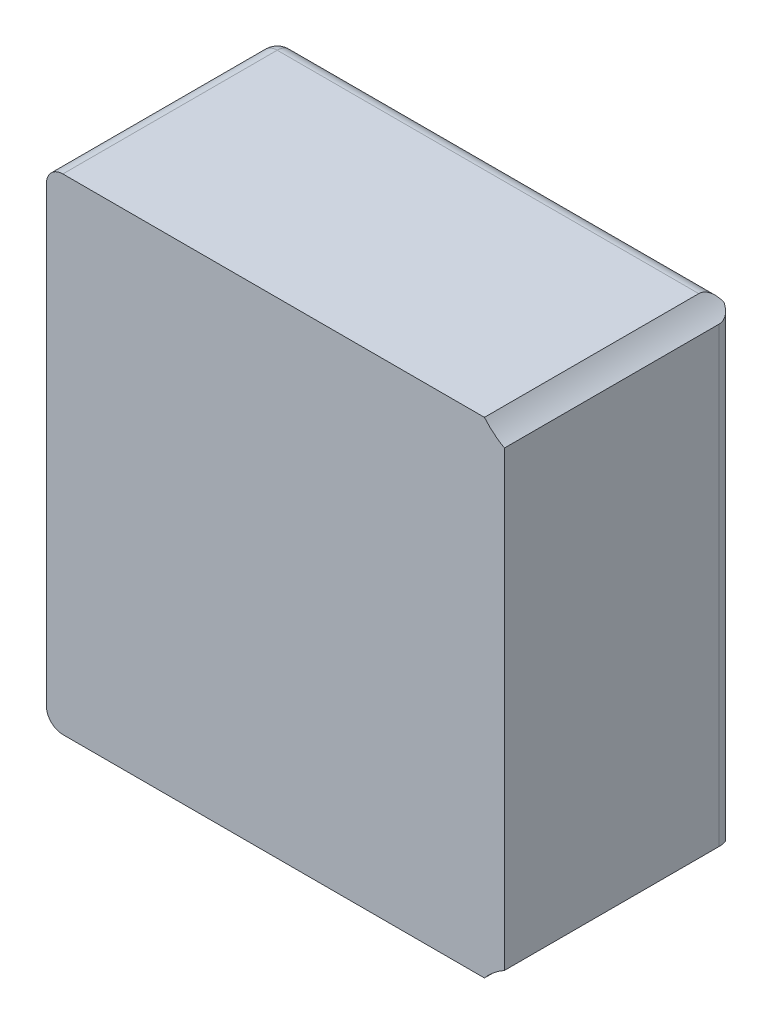
ISO-10303-21;
HEADER;
FILE_DESCRIPTION(('STEP AP214'),'2;1');
FILE_NAME('part.step','',(''),(''),'','','');
FILE_SCHEMA(('AUTOMOTIVE_DESIGN { 1 0 10303 214 1 1 1 1 }'));
ENDSEC;
DATA;
#1=APPLICATION_CONTEXT('core data for automotive mechanical design processes');
#2=APPLICATION_PROTOCOL_DEFINITION('international standard','automotive_design',2000,#1);
#3=PRODUCT_CONTEXT('',#1,'mechanical');
#4=PRODUCT('Part','Part','',(#3));
#5=PRODUCT_RELATED_PRODUCT_CATEGORY('part','',(#4));
#6=PRODUCT_DEFINITION_FORMATION('','',#4);
#7=PRODUCT_DEFINITION_CONTEXT('part definition',#1,'design');
#8=PRODUCT_DEFINITION('design','',#6,#7);
#9=PRODUCT_DEFINITION_SHAPE('','',#8);
#10=(LENGTH_UNIT() NAMED_UNIT(*) SI_UNIT(.MILLI.,.METRE.));
#11=(NAMED_UNIT(*) PLANE_ANGLE_UNIT() SI_UNIT($,.RADIAN.));
#12=(NAMED_UNIT(*) SI_UNIT($,.STERADIAN.) SOLID_ANGLE_UNIT());
#13=UNCERTAINTY_MEASURE_WITH_UNIT(LENGTH_MEASURE(1.E-05),#10,'distance_accuracy_value','');
#14=(GEOMETRIC_REPRESENTATION_CONTEXT(3) GLOBAL_UNCERTAINTY_ASSIGNED_CONTEXT((#13)) GLOBAL_UNIT_ASSIGNED_CONTEXT((#10,
#11,#12)) REPRESENTATION_CONTEXT('',''));
#15=CARTESIAN_POINT('',(0.,0.,0.));
#16=DIRECTION('',(0.,0.,1.));
#17=DIRECTION('',(1.,0.,0.));
#18=AXIS2_PLACEMENT_3D('',#15,#16,#17);
#19=CARTESIAN_POINT('',(97.6105150807782,5.45364491214892,14.));
#20=CARTESIAN_POINT('',(97.957362423811,5.8583970765837,14.));
#21=CARTESIAN_POINT('',(98.3549059432012,6.20182320464996,14.));
#22=CARTESIAN_POINT('',(98.8249350412077,6.45756514132669,14.));
#23=B_SPLINE_CURVE_WITH_KNOTS('',3,(#19,#20,#21,#22),.UNSPECIFIED.,.F.,.F.,(4,4),(0.,1.),.UNSPECIFIED.);
#24=DIRECTION('',(0.,0.,-1.));
#25=VECTOR('',#24,1.);
#26=SURFACE_OF_LINEAR_EXTRUSION('',#23,#25);
#27=CARTESIAN_POINT('',(97.6105150807782,5.45364491214892,0.999999999999999));
#28=CARTESIAN_POINT('',(97.6105144281904,5.45364264963781,0.977081667937636));
#29=CARTESIAN_POINT('',(97.6111907233959,5.45443349795067,0.954175994673404));
#30=CARTESIAN_POINT('',(97.6138829802531,5.45757219398128,0.908560639533463));
#31=CARTESIAN_POINT('',(97.6158983578191,5.45991936285682,0.885850876577851));
#32=CARTESIAN_POINT('',(97.6238979898821,5.46921230686336,0.818533130249394));
#33=CARTESIAN_POINT('',(97.6318362071198,5.47841036560532,0.774435808858496));
#34=CARTESIAN_POINT('',(97.6525869332329,5.50218789967727,0.689038678175605));
#35=CARTESIAN_POINT('',(97.6653933040529,5.51676059765866,0.647735422894864));
#36=CARTESIAN_POINT('',(97.6954160430827,5.55041530067877,0.568695344282839));
#37=CARTESIAN_POINT('',(97.7126372333369,5.56950223457214,0.53096248277215));
#38=CARTESIAN_POINT('',(97.7520310243592,5.61236444728382,0.457642171777818));
#39=CARTESIAN_POINT('',(97.7744284464111,5.63634372180464,0.422296478109556));
#40=CARTESIAN_POINT('',(97.8229085808281,5.68707294808105,0.356496810115855));
#41=CARTESIAN_POINT('',(97.848992684897,5.71382394512519,0.326044692410154));
#42=CARTESIAN_POINT('',(97.9192079923659,5.78398294785302,0.254868812460554));
#43=CARTESIAN_POINT('',(97.9654914848241,5.82860084129502,0.217449155673629));
#44=CARTESIAN_POINT('',(98.0637979702282,5.91905584336986,0.153056737896157));
#45=CARTESIAN_POINT('',(98.1158349014598,5.96489569924367,0.126110094100773));
#46=CARTESIAN_POINT('',(98.2499133642602,6.07704747223135,0.0706293906952575));
#47=CARTESIAN_POINT('',(98.3345403586939,6.14282925200774,0.047329005796763));
#48=CARTESIAN_POINT('',(98.5105283647235,6.26838423162114,0.0151704701939611));
#49=CARTESIAN_POINT('',(98.6018952014117,6.32815212579961,0.00632496904980766));
#50=CARTESIAN_POINT('',(98.7170004962441,6.39666053761393,0.0015447616033489));
#51=CARTESIAN_POINT('',(98.7384528689119,6.40914987431722,0.000915128636762675));
#52=CARTESIAN_POINT('',(98.7815428489236,6.43368275733302,0.000123824232240904));
#53=CARTESIAN_POINT('',(98.803179797807,6.44572741866739,-3.91091023460866E-05));
#54=CARTESIAN_POINT('',(98.8249350412077,6.45756514132669,7.68412792336721E-06));
#55=B_SPLINE_CURVE_WITH_KNOTS('',3,(#27,#28,#29,#30,#31,#32,#33,#34,#35,#36,#37,#38,#39,#40,#41,
#42,#43,#44,#45,#46,#47,#48,#49,#50,#51,#52,#53,#54),.UNSPECIFIED.,.F.,.F.,(4,2,2,2,2,2,2,2,2,2,
2,2,2,4),(0.,0.068706918165359,0.137383887166159,0.273848194485672,0.41014100721337,
0.54658332346819,0.690736489106991,0.834944217899018,1.05683860911758,1.27928285490003,
1.60653083895461,1.93406504672857,2.0085555758593,2.08284450103505),.UNSPECIFIED.);
#56=CARTESIAN_POINT('',(97.6105150807782,5.45364491214892,0.999999999999999));
#57=VERTEX_POINT('',#56);
#58=CARTESIAN_POINT('',(98.2239707958994,6.05460915745689,0.083064633424274));
#59=VERTEX_POINT('',#58);
#60=EDGE_CURVE('E248',#57,#59,#55,.T.);
#61=ORIENTED_EDGE('',*,*,#60,.T.);
#62=CARTESIAN_POINT('',(97.6105150807782,5.45364491214892,0.023258437164949));
#63=CARTESIAN_POINT('',(97.6456892743886,5.49470076942046,0.0155517994449178));
#64=CARTESIAN_POINT('',(97.6816709183293,5.53544090998647,0.00963125760550994));
#65=CARTESIAN_POINT('',(97.7552087736112,5.61607668451945,0.00174229313742816));
#66=CARTESIAN_POINT('',(97.792769184862,5.65596957707132,-0.000214804316745668));
#67=CARTESIAN_POINT('',(97.8696557197014,5.73490514623757,0.000254180500738657));
#68=CARTESIAN_POINT('',(97.9089970452342,5.77393303430793,0.00273026269684683));
#69=CARTESIAN_POINT('',(97.9886795695857,5.85020363095891,0.0126811343130083));
#70=CARTESIAN_POINT('',(98.029019435829,5.88744854266958,0.0201495746459563));
#71=CARTESIAN_POINT('',(98.1209305599001,5.96922654050553,0.043348409345827));
#72=CARTESIAN_POINT('',(98.1726792201679,6.01311726445957,0.0607290705298571));
#73=CARTESIAN_POINT('',(98.2753642306453,6.09618347031103,0.105444496058237));
#74=CARTESIAN_POINT('',(98.3263031238687,6.13537849806546,0.132735945689449));
#75=CARTESIAN_POINT('',(98.4177333639513,6.2025894307852,0.193083091088562));
#76=CARTESIAN_POINT('',(98.4586335879334,6.23139866425919,0.224625801259152));
#77=CARTESIAN_POINT('',(98.5366022547194,6.28436651513706,0.295512391131562));
#78=CARTESIAN_POINT('',(98.5736697945178,6.30852403771823,0.334858102928782));
#79=CARTESIAN_POINT('',(98.6421858484804,6.35179791524872,0.42108028587434));
#80=CARTESIAN_POINT('',(98.6736000520153,6.37088380242484,0.467999664891708));
#81=CARTESIAN_POINT('',(98.7285900503864,6.40349166591151,0.567959594490413));
#82=CARTESIAN_POINT('',(98.7521703643329,6.41701685107958,0.620996592147042));
#83=CARTESIAN_POINT('',(98.7886311244825,6.43761942748115,0.727546820002718));
#84=CARTESIAN_POINT('',(98.8021458262749,6.4450823885012,0.780765968379882));
#85=CARTESIAN_POINT('',(98.8157659568803,6.45256366930849,0.862092763311364));
#86=CARTESIAN_POINT('',(98.8191975213336,6.454438570688,0.889518125120358));
#87=CARTESIAN_POINT('',(98.8237834596355,6.45693881106416,0.944623663833934));
#88=CARTESIAN_POINT('',(98.8249371201796,6.45756375865014,0.972303917830459));
#89=CARTESIAN_POINT('',(98.8249350412078,6.45756514132669,1.00000000000001));
#90=B_SPLINE_CURVE_WITH_KNOTS('',3,(#62,#63,#64,#65,#66,#67,#68,#69,#70,#71,#72,#73,#74,#75,#76,
#77,#78,#79,#80,#81,#82,#83,#84,#85,#86,#87,#88,#89),.UNSPECIFIED.,.F.,.F.,(4,2,2,2,2,2,2,2,2,2,
2,2,2,4),(0.,0.163837701649203,0.328142897514093,0.494312909717666,0.660271994397908,
0.869647464700133,1.07811866872696,1.25480924248848,1.43154135129944,1.60931232881893,
1.78698057738229,1.95219262946424,2.03519278959239,2.11821893633299),.UNSPECIFIED.);
#91=CARTESIAN_POINT('',(98.8249350412076,6.45756514132668,0.999999999999999));
#92=VERTEX_POINT('',#91);
#93=EDGE_CURVE('E148',#59,#92,#90,.T.);
#94=ORIENTED_EDGE('',*,*,#93,.T.);
#95=DIRECTION('',(0.,0.,-1.));
#96=VECTOR('',#95,1.);
#97=CARTESIAN_POINT('',(98.8249350412076,6.45756514132668,14.));
#98=LINE('',#97,#96);
#99=CARTESIAN_POINT('',(98.8249350412076,6.45756514132668,14.));
#100=VERTEX_POINT('',#99);
#101=EDGE_CURVE('E128',#100,#92,#98,.T.);
#102=ORIENTED_EDGE('',*,*,#101,.F.);
#103=CARTESIAN_POINT('',(98.8249350412077,6.45756514132669,14.));
#104=CARTESIAN_POINT('',(98.3549059432012,6.20182320464996,14.));
#105=CARTESIAN_POINT('',(97.957362423811,5.8583970765837,14.));
#106=CARTESIAN_POINT('',(97.6105150807782,5.45364491214892,14.));
#107=B_SPLINE_CURVE_WITH_KNOTS('',3,(#103,#104,#105,#106),.UNSPECIFIED.,.F.,.F.,(4,4),(0.,1.),.UNSPECIFIED.);
#108=CARTESIAN_POINT('',(97.6105150807782,5.45364491214892,14.));
#109=VERTEX_POINT('',#108);
#110=EDGE_CURVE('E134',#109,#100,#107,.F.);
#111=ORIENTED_EDGE('',*,*,#110,.F.);
#112=DIRECTION('',(0.,0.,-1.));
#113=VECTOR('',#112,1.);
#114=CARTESIAN_POINT('',(97.6105150807782,5.45364491214892,14.));
#115=LINE('',#114,#113);
#116=EDGE_CURVE('E303',#109,#57,#115,.T.);
#117=ORIENTED_EDGE('',*,*,#116,.T.);
#118=EDGE_LOOP('',(#61,#94,#102,#111,#117));
#119=FACE_BOUND('',#118,.T.);
#120=ADVANCED_FACE('F36',(#119),#26,.F.);
#121=CARTESIAN_POINT('',(98.8249350412077,33.9009571152319,14.));
#122=DIRECTION('',(-1.,0.,0.));
#123=DIRECTION('',(0.,-1.,0.));
#124=AXIS2_PLACEMENT_3D('',#121,#122,#123);
#125=PLANE('',#124);
#126=ORIENTED_EDGE('',*,*,#101,.T.);
#127=DIRECTION('',(0.,1.,0.));
#128=VECTOR('',#127,1.);
#129=CARTESIAN_POINT('',(98.8249350412077,33.9009571152319,0.999999999999999));
#130=LINE('',#129,#128);
#131=CARTESIAN_POINT('',(98.8249350412077,33.9009571152319,0.999999999999999));
#132=VERTEX_POINT('',#131);
#133=EDGE_CURVE('E149',#92,#132,#130,.T.);
#134=ORIENTED_EDGE('',*,*,#133,.T.);
#135=DIRECTION('',(0.,0.,-1.));
#136=VECTOR('',#135,1.);
#137=CARTESIAN_POINT('',(98.8249350412077,33.9009571152319,14.));
#138=LINE('',#137,#136);
#139=CARTESIAN_POINT('',(98.8249350412077,33.9009571152319,14.));
#140=VERTEX_POINT('',#139);
#141=EDGE_CURVE('E131',#140,#132,#138,.T.);
#142=ORIENTED_EDGE('',*,*,#141,.F.);
#143=DIRECTION('',(0.,1.,0.));
#144=VECTOR('',#143,1.);
#145=CARTESIAN_POINT('',(98.8249350412077,33.9009571152319,14.));
#146=LINE('',#145,#144);
#147=EDGE_CURVE('E123',#100,#140,#146,.T.);
#148=ORIENTED_EDGE('',*,*,#147,.F.);
#149=EDGE_LOOP('',(#126,#134,#142,#148));
#150=FACE_BOUND('',#149,.T.);
#151=ADVANCED_FACE('F125',(#150),#125,.F.);
#152=CARTESIAN_POINT('',(98.8249350412077,33.9009571152319,14.));
#153=CARTESIAN_POINT('',(98.3549059420193,34.1566990525517,14.));
#154=CARTESIAN_POINT('',(97.9573624339175,34.5001252002607,14.));
#155=CARTESIAN_POINT('',(97.6105150906763,34.9048773626016,14.));
#156=B_SPLINE_CURVE_WITH_KNOTS('',3,(#152,#153,#154,#155),.UNSPECIFIED.,.F.,.F.,(4,4),(0.,1.),.UNSPECIFIED.);
#157=DIRECTION('',(0.,0.,-1.));
#158=VECTOR('',#157,1.);
#159=SURFACE_OF_LINEAR_EXTRUSION('',#156,#158);
#160=ORIENTED_EDGE('',*,*,#141,.T.);
#161=CARTESIAN_POINT('',(98.8249350412077,33.9009571152319,0.999999999999999));
#162=CARTESIAN_POINT('',(98.8249362438431,33.9009581762692,0.974751058401219));
#163=CARTESIAN_POINT('',(98.8239780190628,33.9014776480358,0.949514700102299));
#164=CARTESIAN_POINT('',(98.8201645505362,33.9035560584132,0.899233037686511));
#165=CARTESIAN_POINT('',(98.8173096260898,33.9051148220646,0.874187702129614));
#166=CARTESIAN_POINT('',(98.8059591864594,33.911339401252,0.799752110740666));
#167=CARTESIAN_POINT('',(98.794677655642,33.9175535001919,0.750879381318651));
#168=CARTESIAN_POINT('',(98.7652295337208,33.9340907186925,0.6560285097351));
#169=CARTESIAN_POINT('',(98.7470632614002,33.9444136480037,0.610050233667072));
#170=CARTESIAN_POINT('',(98.7047164053236,33.9691001753442,0.522123833441968));
#171=CARTESIAN_POINT('',(98.6805345976536,33.9834645957287,0.480176531833018));
#172=CARTESIAN_POINT('',(98.6265702942513,34.0165069582225,0.400192112484578));
#173=CARTESIAN_POINT('',(98.5966583304111,34.0352875034305,0.362285292521506));
#174=CARTESIAN_POINT('',(98.5329836538755,34.0766710234713,0.292250059018813));
#175=CARTESIAN_POINT('',(98.4992195793893,34.0992753514521,0.260123699384218));
#176=CARTESIAN_POINT('',(98.4256691751153,34.1503460291664,0.19898445625974));
#177=CARTESIAN_POINT('',(98.3856174409995,34.1791709141211,0.170592907612779));
#178=CARTESIAN_POINT('',(98.303939835097,34.2404058587712,0.120884179783364));
#179=CARTESIAN_POINT('',(98.2623132929785,34.2728174567459,0.0995700517851871));
#180=CARTESIAN_POINT('',(98.157705808858,34.3576445240411,0.0545179387674308));
#181=CARTESIAN_POINT('',(98.0944711273182,34.4119487269819,0.0349122232304204));
#182=CARTESIAN_POINT('',(97.9696726808488,34.5255410327844,0.00846379739683166));
#183=CARTESIAN_POINT('',(97.9081150750178,34.5848448945912,0.00166314948409855));
#184=CARTESIAN_POINT('',(97.8067675213699,34.6878401707598,-0.000692265456712929));
#185=CARTESIAN_POINT('',(97.7661350610964,34.7306855415623,0.000924682636549816));
#186=CARTESIAN_POINT('',(97.6868749660855,34.8171950477451,0.00878730443834067));
#187=CARTESIAN_POINT('',(97.6482344968972,34.8608505442227,0.0149978916928505));
#188=CARTESIAN_POINT('',(97.6105150906763,34.9048773626016,0.0232584349920684));
#189=B_SPLINE_CURVE_WITH_KNOTS('',3,(#161,#162,#163,#164,#165,#166,#167,#168,#169,#170,#171,
#172,#173,#174,#175,#176,#177,#178,#179,#180,#181,#182,#183,#184,#185,#186,#187,#188),
.UNSPECIFIED.,.F.,.F.,(4,2,2,2,2,2,2,2,2,2,2,2,2,4),(0.,0.0756985257886365,0.151384311338969,
0.302214469309151,0.453037644267384,0.603891530670632,0.758674466439555,0.913512291321303,
1.08365012028226,1.25386120331903,1.5093188547171,1.76561418528502,1.94261814250265,
2.11828391655872),.UNSPECIFIED.);
#190=CARTESIAN_POINT('',(98.2239707925065,34.3039131139004,0.0830646319476043));
#191=VERTEX_POINT('',#190);
#192=EDGE_CURVE('E168',#132,#191,#189,.T.);
#193=ORIENTED_EDGE('',*,*,#192,.T.);
#194=CARTESIAN_POINT('',(98.8249350412077,33.9009571152319,7.68419924261979E-06));
#195=CARTESIAN_POINT('',(98.7655886820896,33.9332359953319,-9.41459643886954E-05));
#196=CARTESIAN_POINT('',(98.707094802894,33.9671034934114,0.00131534350932905));
#197=CARTESIAN_POINT('',(98.5914624819735,34.0381103556953,0.00825851113033593));
#198=CARTESIAN_POINT('',(98.5343473752789,34.0752828781664,0.0138394487421541));
#199=CARTESIAN_POINT('',(98.3909524347141,34.1739463454297,0.0349168427435199));
#200=CARTESIAN_POINT('',(98.3063986135857,34.2373250369933,0.0542310787866778));
#201=CARTESIAN_POINT('',(98.186178559868,34.334440830268,0.0962808371506677));
#202=CARTESIAN_POINT('',(98.1472803182974,34.3670847598162,0.112430557727617));
#203=CARTESIAN_POINT('',(98.0720099373515,34.4324471033215,0.149656550865163));
#204=CARTESIAN_POINT('',(98.0356355239642,34.4651654220577,0.170728311810153));
#205=CARTESIAN_POINT('',(97.9613524510172,34.5340829961723,0.221437158743859));
#206=CARTESIAN_POINT('',(97.9238584038932,34.5701822543117,0.251831365633254));
#207=CARTESIAN_POINT('',(97.8536394000742,34.6398500919688,0.320155121545799));
#208=CARTESIAN_POINT('',(97.8209106193209,34.6734206901404,0.358078570042944));
#209=CARTESIAN_POINT('',(97.7659032837975,34.7312321495456,0.435122202237449));
#210=CARTESIAN_POINT('',(97.7427916455433,34.7561137790005,0.473160604971699));
#211=CARTESIAN_POINT('',(97.7014983361687,34.8012961572884,0.55436766668392));
#212=CARTESIAN_POINT('',(97.6833170902469,34.8215965110052,0.597536767673544));
#213=CARTESIAN_POINT('',(97.6525129756614,34.8563746930622,0.688483295695676));
#214=CARTESIAN_POINT('',(97.6399364433184,34.8708039002967,0.736295298361718));
#215=CARTESIAN_POINT('',(97.6212191287624,34.8923946346756,0.834685634080232));
#216=CARTESIAN_POINT('',(97.6150604442172,34.8995763765572,0.885255855697638));
#217=CARTESIAN_POINT('',(97.611680601167,34.9035178417552,0.946779532432597));
#218=CARTESIAN_POINT('',(97.6112434138164,34.9040276896368,0.957419894014711));
#219=CARTESIAN_POINT('',(97.6106611730673,34.9047067791611,0.978705327630038));
#220=CARTESIAN_POINT('',(97.6105157325044,34.9048764722084,0.989350374644694));
#221=CARTESIAN_POINT('',(97.6105150906763,34.9048773626016,0.999999999999999));
#222=B_SPLINE_CURVE_WITH_KNOTS('',3,(#194,#195,#196,#197,#198,#199,#200,#201,#202,#203,#204,
#205,#206,#207,#208,#209,#210,#211,#212,#213,#214,#215,#216,#217,#218,#219,#220,#221),
.UNSPECIFIED.,.F.,.F.,(4,2,2,2,2,2,2,2,2,2,2,2,2,4),(0.,0.202615914076961,0.407562787622504,
0.728139394136735,0.887771771465733,1.04725839761419,1.22746493131245,1.40752604521165,
1.55988444942851,1.71225598890856,1.86586487712148,2.01904412301151,2.05102396939923,
2.08296134858136),.UNSPECIFIED.);
#223=CARTESIAN_POINT('',(97.6105150906763,34.9048773626016,0.999999999999999));
#224=VERTEX_POINT('',#223);
#225=EDGE_CURVE('E151',#191,#224,#222,.T.);
#226=ORIENTED_EDGE('',*,*,#225,.T.);
#227=DIRECTION('',(0.,0.,-1.));
#228=VECTOR('',#227,1.);
#229=CARTESIAN_POINT('',(97.6105150906763,34.9048773626016,14.));
#230=LINE('',#229,#228);
#231=CARTESIAN_POINT('',(97.6105150906763,34.9048773626016,14.));
#232=VERTEX_POINT('',#231);
#233=EDGE_CURVE('E153',#232,#224,#230,.T.);
#234=ORIENTED_EDGE('',*,*,#233,.F.);
#235=CARTESIAN_POINT('',(97.6105150906763,34.9048773626016,14.));
#236=CARTESIAN_POINT('',(97.9573624339175,34.5001252002607,14.));
#237=CARTESIAN_POINT('',(98.3549059420193,34.1566990525517,14.));
#238=CARTESIAN_POINT('',(98.8249350412077,33.9009571152319,14.));
#239=B_SPLINE_CURVE_WITH_KNOTS('',3,(#235,#236,#237,#238),.UNSPECIFIED.,.F.,.F.,(4,4),(0.,1.),.UNSPECIFIED.);
#240=EDGE_CURVE('E133',#140,#232,#239,.F.);
#241=ORIENTED_EDGE('',*,*,#240,.F.);
#242=EDGE_LOOP('',(#160,#193,#226,#234,#241));
#243=FACE_BOUND('',#242,.T.);
#244=ADVANCED_FACE('F178',(#243),#159,.F.);
#245=CARTESIAN_POINT('',(71.0404814985495,34.9048773626016,14.));
#246=DIRECTION('',(0.,-1.,0.));
#247=DIRECTION('',(0.,0.,-1.));
#248=AXIS2_PLACEMENT_3D('',#245,#246,#247);
#249=PLANE('',#248);
#250=DIRECTION('',(-1.,0.,0.));
#251=VECTOR('',#250,1.);
#252=CARTESIAN_POINT('',(71.0404814985495,34.9048773626016,0.999999999999999));
#253=LINE('',#252,#251);
#254=CARTESIAN_POINT('',(72.0404814985495,34.9048773626016,0.999999999999999));
#255=VERTEX_POINT('',#254);
#256=EDGE_CURVE('E316',#224,#255,#253,.T.);
#257=ORIENTED_EDGE('',*,*,#256,.T.);
#258=DIRECTION('',(0.,0.,-1.));
#259=VECTOR('',#258,1.);
#260=CARTESIAN_POINT('',(72.0404814985495,34.9048773626016,14.));
#261=LINE('',#260,#259);
#262=CARTESIAN_POINT('',(72.0404814985495,34.9048773626016,14.));
#263=VERTEX_POINT('',#262);
#264=EDGE_CURVE('E61',#255,#263,#261,.F.);
#265=ORIENTED_EDGE('',*,*,#264,.T.);
#266=DIRECTION('',(-1.,0.,0.));
#267=VECTOR('',#266,1.);
#268=CARTESIAN_POINT('',(71.0404814985495,34.9048773626016,14.));
#269=LINE('',#268,#267);
#270=EDGE_CURVE('E204',#232,#263,#269,.T.);
#271=ORIENTED_EDGE('',*,*,#270,.F.);
#272=ORIENTED_EDGE('',*,*,#233,.T.);
#273=EDGE_LOOP('',(#257,#265,#271,#272));
#274=FACE_BOUND('',#273,.T.);
#275=ADVANCED_FACE('F184',(#274),#249,.F.);
#276=CARTESIAN_POINT('',(71.0404814985495,34.9048773626016,14.));
#277=DIRECTION('',(1.,0.,0.));
#278=DIRECTION('',(0.,0.,-1.));
#279=AXIS2_PLACEMENT_3D('',#276,#277,#278);
#280=PLANE('',#279);
#281=DIRECTION('',(0.,-1.,0.));
#282=VECTOR('',#281,1.);
#283=CARTESIAN_POINT('',(71.0404814985495,34.9048773626016,14.));
#284=LINE('',#283,#282);
#285=CARTESIAN_POINT('',(71.0404814985495,33.9048773626016,14.));
#286=VERTEX_POINT('',#285);
#287=CARTESIAN_POINT('',(71.0404814985495,6.45364491214892,14.));
#288=VERTEX_POINT('',#287);
#289=EDGE_CURVE('E199',#286,#288,#284,.T.);
#290=ORIENTED_EDGE('',*,*,#289,.F.);
#291=DIRECTION('',(0.,0.,-1.));
#292=VECTOR('',#291,1.);
#293=CARTESIAN_POINT('',(71.0404814985495,33.9048773626016,14.));
#294=LINE('',#293,#292);
#295=CARTESIAN_POINT('',(71.0404814985495,33.9048773626016,0.999999999999999));
#296=VERTEX_POINT('',#295);
#297=EDGE_CURVE('E305',#286,#296,#294,.T.);
#298=ORIENTED_EDGE('',*,*,#297,.T.);
#299=DIRECTION('',(0.,-1.,0.));
#300=VECTOR('',#299,1.);
#301=CARTESIAN_POINT('',(71.0404814985495,34.9048773626016,0.999999999999999));
#302=LINE('',#301,#300);
#303=CARTESIAN_POINT('',(71.0404814985495,6.45364491214892,0.999999999999999));
#304=VERTEX_POINT('',#303);
#305=EDGE_CURVE('E319',#296,#304,#302,.T.);
#306=ORIENTED_EDGE('',*,*,#305,.T.);
#307=DIRECTION('',(0.,0.,-1.));
#308=VECTOR('',#307,1.);
#309=CARTESIAN_POINT('',(71.0404814985495,6.45364491214892,14.));
#310=LINE('',#309,#308);
#311=EDGE_CURVE('E307',#304,#288,#310,.F.);
#312=ORIENTED_EDGE('',*,*,#311,.T.);
#313=EDGE_LOOP('',(#290,#298,#306,#312));
#314=FACE_BOUND('',#313,.T.);
#315=ADVANCED_FACE('F362',(#314),#280,.F.);
#316=CARTESIAN_POINT('',(97.6105150807782,5.45364491214892,14.));
#317=DIRECTION('',(0.,1.,0.));
#318=DIRECTION('',(0.,0.,1.));
#319=AXIS2_PLACEMENT_3D('',#316,#317,#318);
#320=PLANE('',#319);
#321=DIRECTION('',(1.,0.,0.));
#322=VECTOR('',#321,1.);
#323=CARTESIAN_POINT('',(97.6105150807782,5.45364491214892,14.));
#324=LINE('',#323,#322);
#325=CARTESIAN_POINT('',(72.0404814985495,5.45364491214892,14.));
#326=VERTEX_POINT('',#325);
#327=EDGE_CURVE('E139',#326,#109,#324,.T.);
#328=ORIENTED_EDGE('',*,*,#327,.F.);
#329=DIRECTION('',(0.,0.,-1.));
#330=VECTOR('',#329,1.);
#331=CARTESIAN_POINT('',(72.0404814985495,5.45364491214892,14.));
#332=LINE('',#331,#330);
#333=CARTESIAN_POINT('',(72.0404814985495,5.45364491214892,0.999999999999999));
#334=VERTEX_POINT('',#333);
#335=EDGE_CURVE('E11',#326,#334,#332,.T.);
#336=ORIENTED_EDGE('',*,*,#335,.T.);
#337=DIRECTION('',(1.,0.,0.));
#338=VECTOR('',#337,1.);
#339=CARTESIAN_POINT('',(97.6105150807782,5.45364491214892,0.999999999999999));
#340=LINE('',#339,#338);
#341=EDGE_CURVE('E321',#334,#57,#340,.T.);
#342=ORIENTED_EDGE('',*,*,#341,.T.);
#343=ORIENTED_EDGE('',*,*,#116,.F.);
#344=EDGE_LOOP('',(#328,#336,#342,#343));
#345=FACE_BOUND('',#344,.T.);
#346=ADVANCED_FACE('F220',(#345),#320,.F.);
#347=CARTESIAN_POINT('',(98.1715319028778,6.01148386214707,14.));
#348=DIRECTION('',(0.,0.,1.));
#349=DIRECTION('',(1.,0.,0.));
#350=AXIS2_PLACEMENT_3D('',#347,#348,#349);
#351=PLANE('',#350);
#352=ORIENTED_EDGE('',*,*,#270,.T.);
#353=CARTESIAN_POINT('',(72.0404814985495,33.9048773626016,14.));
#354=DIRECTION('',(0.,0.,1.));
#355=DIRECTION('',(1.,0.,0.));
#356=AXIS2_PLACEMENT_3D('',#353,#354,#355);
#357=CIRCLE('',#356,1.);
#358=EDGE_CURVE('E45',#263,#286,#357,.T.);
#359=ORIENTED_EDGE('',*,*,#358,.T.);
#360=ORIENTED_EDGE('',*,*,#289,.T.);
#361=CARTESIAN_POINT('',(72.0404814985495,6.45364491214892,14.));
#362=DIRECTION('',(0.,0.,1.));
#363=DIRECTION('',(1.,0.,0.));
#364=AXIS2_PLACEMENT_3D('',#361,#362,#363);
#365=CIRCLE('',#364,1.);
#366=EDGE_CURVE('E53',#288,#326,#365,.T.);
#367=ORIENTED_EDGE('',*,*,#366,.T.);
#368=ORIENTED_EDGE('',*,*,#327,.T.);
#369=ORIENTED_EDGE('',*,*,#110,.T.);
#370=ORIENTED_EDGE('',*,*,#147,.T.);
#371=ORIENTED_EDGE('',*,*,#240,.T.);
#372=EDGE_LOOP('',(#352,#359,#360,#367,#368,#369,#370,#371));
#373=FACE_BOUND('',#372,.T.);
#374=ADVANCED_FACE('F138',(#373),#351,.T.);
#375=CARTESIAN_POINT('',(98.1715319028778,6.01148386214707,0.));
#376=DIRECTION('',(0.,0.,1.));
#377=DIRECTION('',(1.,0.,0.));
#378=AXIS2_PLACEMENT_3D('',#375,#376,#377);
#379=PLANE('',#378);
#380=DIRECTION('',(-1.,0.,0.));
#381=VECTOR('',#380,1.);
#382=CARTESIAN_POINT('',(98.1715319028778,33.9048773626016,0.));
#383=LINE('',#382,#381);
#384=CARTESIAN_POINT('',(72.0404814985495,33.9048773626016,0.));
#385=VERTEX_POINT('',#384);
#386=CARTESIAN_POINT('',(97.8249350412076,33.9048773626016,0.));
#387=VERTEX_POINT('',#386);
#388=EDGE_CURVE('E355',#385,#387,#383,.F.);
#389=ORIENTED_EDGE('',*,*,#388,.T.);
#390=DIRECTION('',(0.,1.,0.));
#391=VECTOR('',#390,1.);
#392=CARTESIAN_POINT('',(97.8249350412076,6.01148386214707,0.));
#393=LINE('',#392,#391);
#394=CARTESIAN_POINT('',(97.8249350412076,6.45364491214892,0.));
#395=VERTEX_POINT('',#394);
#396=EDGE_CURVE('E254',#387,#395,#393,.F.);
#397=ORIENTED_EDGE('',*,*,#396,.T.);
#398=DIRECTION('',(1.,0.,0.));
#399=VECTOR('',#398,1.);
#400=CARTESIAN_POINT('',(98.1715319028778,6.45364491214892,0.));
#401=LINE('',#400,#399);
#402=CARTESIAN_POINT('',(72.0404814985495,6.45364491214892,0.));
#403=VERTEX_POINT('',#402);
#404=EDGE_CURVE('E328',#395,#403,#401,.F.);
#405=ORIENTED_EDGE('',*,*,#404,.T.);
#406=DIRECTION('',(0.,-1.,0.));
#407=VECTOR('',#406,1.);
#408=CARTESIAN_POINT('',(72.0404814985495,6.01148386214707,0.));
#409=LINE('',#408,#407);
#410=EDGE_CURVE('E363',#403,#385,#409,.F.);
#411=ORIENTED_EDGE('',*,*,#410,.T.);
#412=EDGE_LOOP('',(#389,#397,#405,#411));
#413=FACE_BOUND('',#412,.T.);
#414=ADVANCED_FACE('F219',(#413),#379,.F.);
#415=CARTESIAN_POINT('',(72.0404814985495,34.9048773626016,0.999999999999999));
#416=DIRECTION('',(0.,-1.,0.));
#417=DIRECTION('',(0.,0.,-1.));
#418=AXIS2_PLACEMENT_3D('',#415,#416,#417);
#419=CYLINDRICAL_SURFACE('',#418,1.);
#420=ORIENTED_EDGE('',*,*,#305,.F.);
#421=CARTESIAN_POINT('',(72.0404814985495,33.9048773626016,0.999999999999999));
#422=DIRECTION('',(0.,-1.,0.));
#423=DIRECTION('',(0.,0.,-1.));
#424=AXIS2_PLACEMENT_3D('',#421,#422,#423);
#425=CIRCLE('',#424,1.);
#426=EDGE_CURVE('E310',#296,#385,#425,.T.);
#427=ORIENTED_EDGE('',*,*,#426,.T.);
#428=ORIENTED_EDGE('',*,*,#410,.F.);
#429=CARTESIAN_POINT('',(72.0404814985495,6.45364491214892,0.999999999999999));
#430=DIRECTION('',(0.,-1.,0.));
#431=DIRECTION('',(0.,0.,-1.));
#432=AXIS2_PLACEMENT_3D('',#429,#430,#431);
#433=CIRCLE('',#432,1.);
#434=EDGE_CURVE('E287',#403,#304,#433,.F.);
#435=ORIENTED_EDGE('',*,*,#434,.T.);
#436=EDGE_LOOP('',(#420,#427,#428,#435));
#437=FACE_BOUND('',#436,.T.);
#438=ADVANCED_FACE('F265',(#437),#419,.T.);
#439=CARTESIAN_POINT('',(97.6105150807782,6.45364491214892,0.999999999999999));
#440=DIRECTION('',(1.,0.,0.));
#441=DIRECTION('',(0.,0.,-1.));
#442=AXIS2_PLACEMENT_3D('',#439,#440,#441);
#443=CYLINDRICAL_SURFACE('',#442,1.);
#444=ORIENTED_EDGE('',*,*,#341,.F.);
#445=CARTESIAN_POINT('',(72.0404814985495,6.45364491214892,0.999999999999999));
#446=DIRECTION('',(1.,0.,0.));
#447=DIRECTION('',(0.,0.,-1.));
#448=AXIS2_PLACEMENT_3D('',#445,#446,#447);
#449=CIRCLE('',#448,1.);
#450=EDGE_CURVE('E289',#334,#403,#449,.T.);
#451=ORIENTED_EDGE('',*,*,#450,.T.);
#452=ORIENTED_EDGE('',*,*,#404,.F.);
#453=CARTESIAN_POINT('',(97.8249350412076,6.45364491214892,0.999999999999999));
#454=DIRECTION('',(0.707106781186549,0.707106781186546,0.));
#455=DIRECTION('',(0.707106781186546,-0.707106781186549,0.));
#456=AXIS2_PLACEMENT_3D('',#453,#454,#455);
#457=ELLIPSE('',#456,1.41421356237309,1.);
#458=EDGE_CURVE('E144',#59,#395,#457,.T.);
#459=ORIENTED_EDGE('',*,*,#458,.F.);
#460=ORIENTED_EDGE('',*,*,#60,.F.);
#461=EDGE_LOOP('',(#444,#451,#452,#459,#460));
#462=FACE_BOUND('',#461,.T.);
#463=ADVANCED_FACE('F261',(#462),#443,.T.);
#464=CARTESIAN_POINT('',(71.0404814985495,33.9048773626016,0.999999999999999));
#465=DIRECTION('',(-1.,0.,0.));
#466=DIRECTION('',(0.,0.,1.));
#467=AXIS2_PLACEMENT_3D('',#464,#465,#466);
#468=CYLINDRICAL_SURFACE('',#467,1.);
#469=ORIENTED_EDGE('',*,*,#388,.F.);
#470=CARTESIAN_POINT('',(72.0404814985495,33.9048773626016,0.999999999999999));
#471=DIRECTION('',(-1.,0.,0.));
#472=DIRECTION('',(0.,0.,1.));
#473=AXIS2_PLACEMENT_3D('',#470,#471,#472);
#474=CIRCLE('',#473,1.);
#475=EDGE_CURVE('E313',#385,#255,#474,.F.);
#476=ORIENTED_EDGE('',*,*,#475,.T.);
#477=ORIENTED_EDGE('',*,*,#256,.F.);
#478=ORIENTED_EDGE('',*,*,#225,.F.);
#479=CARTESIAN_POINT('',(97.8249350412077,33.9048773626016,0.999999999999999));
#480=DIRECTION('',(-0.707106781186546,0.707106781186549,0.));
#481=DIRECTION('',(0.707106781186549,0.707106781186546,0.));
#482=AXIS2_PLACEMENT_3D('',#479,#480,#481);
#483=ELLIPSE('',#482,1.4142135623731,1.);
#484=EDGE_CURVE('E293',#387,#191,#483,.F.);
#485=ORIENTED_EDGE('',*,*,#484,.F.);
#486=EDGE_LOOP('',(#469,#476,#477,#478,#485));
#487=FACE_BOUND('',#486,.T.);
#488=ADVANCED_FACE('F175',(#487),#468,.T.);
#489=CARTESIAN_POINT('',(97.8249350412077,33.9009571152319,0.999999999999999));
#490=DIRECTION('',(0.,1.,0.));
#491=DIRECTION('',(-1.,0.,0.));
#492=AXIS2_PLACEMENT_3D('',#489,#490,#491);
#493=CYLINDRICAL_SURFACE('',#492,1.);
#494=ORIENTED_EDGE('',*,*,#458,.T.);
#495=ORIENTED_EDGE('',*,*,#396,.F.);
#496=ORIENTED_EDGE('',*,*,#484,.T.);
#497=ORIENTED_EDGE('',*,*,#192,.F.);
#498=ORIENTED_EDGE('',*,*,#133,.F.);
#499=ORIENTED_EDGE('',*,*,#93,.F.);
#500=EDGE_LOOP('',(#494,#495,#496,#497,#498,#499));
#501=FACE_BOUND('',#500,.T.);
#502=ADVANCED_FACE('F242',(#501),#493,.T.);
#503=CARTESIAN_POINT('',(72.0404814985495,33.9048773626016,14.));
#504=DIRECTION('',(0.,0.,-1.));
#505=DIRECTION('',(-1.,0.,0.));
#506=AXIS2_PLACEMENT_3D('',#503,#504,#505);
#507=CYLINDRICAL_SURFACE('',#506,1.);
#508=ORIENTED_EDGE('',*,*,#358,.F.);
#509=ORIENTED_EDGE('',*,*,#264,.F.);
#510=CARTESIAN_POINT('',(72.0404814985495,33.9048773626016,0.999999999999999));
#511=DIRECTION('',(0.,0.,-1.));
#512=DIRECTION('',(-1.,0.,0.));
#513=AXIS2_PLACEMENT_3D('',#510,#511,#512);
#514=CIRCLE('',#513,1.);
#515=EDGE_CURVE('E292',#296,#255,#514,.T.);
#516=ORIENTED_EDGE('',*,*,#515,.F.);
#517=ORIENTED_EDGE('',*,*,#297,.F.);
#518=EDGE_LOOP('',(#508,#509,#516,#517));
#519=FACE_BOUND('',#518,.T.);
#520=ADVANCED_FACE('F273',(#519),#507,.T.);
#521=CARTESIAN_POINT('',(72.0404814985495,33.9048773626016,0.999999999999999));
#522=DIRECTION('',(0.,0.,1.));
#523=DIRECTION('',(1.,0.,0.));
#524=AXIS2_PLACEMENT_3D('',#521,#522,#523);
#525=SPHERICAL_SURFACE('',#524,1.);
#526=ORIENTED_EDGE('',*,*,#475,.F.);
#527=ORIENTED_EDGE('',*,*,#426,.F.);
#528=ORIENTED_EDGE('',*,*,#515,.T.);
#529=EDGE_LOOP('',(#526,#527,#528));
#530=FACE_BOUND('',#529,.T.);
#531=ADVANCED_FACE('F270',(#530),#525,.T.);
#532=CARTESIAN_POINT('',(72.0404814985495,6.45364491214892,14.));
#533=DIRECTION('',(0.,0.,-1.));
#534=DIRECTION('',(-1.,0.,0.));
#535=AXIS2_PLACEMENT_3D('',#532,#533,#534);
#536=CYLINDRICAL_SURFACE('',#535,1.);
#537=ORIENTED_EDGE('',*,*,#366,.F.);
#538=ORIENTED_EDGE('',*,*,#311,.F.);
#539=CARTESIAN_POINT('',(72.0404814985495,6.45364491214892,0.999999999999999));
#540=DIRECTION('',(0.,0.,-1.));
#541=DIRECTION('',(-1.,0.,0.));
#542=AXIS2_PLACEMENT_3D('',#539,#540,#541);
#543=CIRCLE('',#542,1.);
#544=EDGE_CURVE('E40',#334,#304,#543,.T.);
#545=ORIENTED_EDGE('',*,*,#544,.F.);
#546=ORIENTED_EDGE('',*,*,#335,.F.);
#547=EDGE_LOOP('',(#537,#538,#545,#546));
#548=FACE_BOUND('',#547,.T.);
#549=ADVANCED_FACE('F38',(#548),#536,.T.);
#550=CARTESIAN_POINT('',(72.0404814985495,6.45364491214892,0.999999999999999));
#551=DIRECTION('',(0.,0.,1.));
#552=DIRECTION('',(1.,0.,0.));
#553=AXIS2_PLACEMENT_3D('',#550,#551,#552);
#554=SPHERICAL_SURFACE('',#553,1.);
#555=ORIENTED_EDGE('',*,*,#544,.T.);
#556=ORIENTED_EDGE('',*,*,#434,.F.);
#557=ORIENTED_EDGE('',*,*,#450,.F.);
#558=EDGE_LOOP('',(#555,#556,#557));
#559=FACE_BOUND('',#558,.T.);
#560=ADVANCED_FACE('F277',(#559),#554,.T.);
#561=CLOSED_SHELL('',(#120,#151,#244,#275,#315,#346,#374,#414,#438,#463,#488,#502,#520,#531,
#549,#560));
#562=MANIFOLD_SOLID_BREP('B2',#561);
#563=ADVANCED_BREP_SHAPE_REPRESENTATION('',(#18,#562),#14);
#564=SHAPE_DEFINITION_REPRESENTATION(#9,#563);
ENDSEC;
END-ISO-10303-21;
